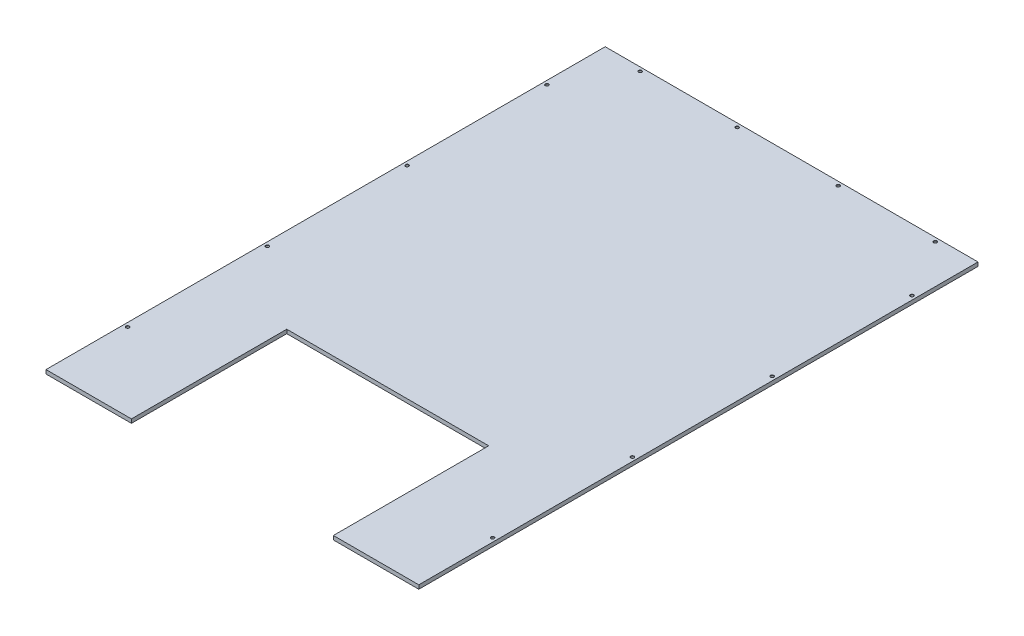
ISO-10303-21;
HEADER;
FILE_DESCRIPTION(('STEP AP214'),'2;1');
FILE_NAME('part.step','',(''),(''),'','','');
FILE_SCHEMA(('AUTOMOTIVE_DESIGN { 1 0 10303 214 1 1 1 1 }'));
ENDSEC;
DATA;
#1=APPLICATION_CONTEXT('core data for automotive mechanical design processes');
#2=APPLICATION_PROTOCOL_DEFINITION('international standard','automotive_design',2000,#1);
#3=PRODUCT_CONTEXT('',#1,'mechanical');
#4=PRODUCT('Part','Part','',(#3));
#5=PRODUCT_RELATED_PRODUCT_CATEGORY('part','',(#4));
#6=PRODUCT_DEFINITION_FORMATION('','',#4);
#7=PRODUCT_DEFINITION_CONTEXT('part definition',#1,'design');
#8=PRODUCT_DEFINITION('design','',#6,#7);
#9=PRODUCT_DEFINITION_SHAPE('','',#8);
#10=(LENGTH_UNIT() NAMED_UNIT(*) SI_UNIT(.MILLI.,.METRE.));
#11=(NAMED_UNIT(*) PLANE_ANGLE_UNIT() SI_UNIT($,.RADIAN.));
#12=(NAMED_UNIT(*) SI_UNIT($,.STERADIAN.) SOLID_ANGLE_UNIT());
#13=UNCERTAINTY_MEASURE_WITH_UNIT(LENGTH_MEASURE(1.E-05),#10,'distance_accuracy_value','');
#14=(GEOMETRIC_REPRESENTATION_CONTEXT(3) GLOBAL_UNCERTAINTY_ASSIGNED_CONTEXT((#13)) GLOBAL_UNIT_ASSIGNED_CONTEXT((#10,
#11,#12)) REPRESENTATION_CONTEXT('',''));
#15=CARTESIAN_POINT('',(0.,0.,0.));
#16=DIRECTION('',(0.,0.,1.));
#17=DIRECTION('',(1.,0.,0.));
#18=AXIS2_PLACEMENT_3D('',#15,#16,#17);
#19=CARTESIAN_POINT('',(0.,12.7,1828.8));
#20=DIRECTION('',(0.,-1.,0.));
#21=DIRECTION('',(0.,0.,-1.));
#22=AXIS2_PLACEMENT_3D('',#19,#20,#21);
#23=PLANE('',#22);
#24=CARTESIAN_POINT('',(1206.5,12.7,1574.8));
#25=DIRECTION('',(0.,1.,0.));
#26=DIRECTION('',(0.,0.,1.));
#27=AXIS2_PLACEMENT_3D('',#24,#25,#26);
#28=CIRCLE('',#27,5.39749999999994);
#29=CARTESIAN_POINT('',(1206.5,12.7,1580.1975));
#30=VERTEX_POINT('',#29);
#31=EDGE_CURVE('E502',#30,#30,#28,.T.);
#32=ORIENTED_EDGE('',*,*,#31,.F.);
#33=EDGE_LOOP('',(#32));
#34=FACE_BOUND('',#33,.T.);
#35=CARTESIAN_POINT('',(1206.5,12.7,1117.6));
#36=DIRECTION('',(0.,1.,0.));
#37=DIRECTION('',(0.,0.,1.));
#38=AXIS2_PLACEMENT_3D('',#35,#36,#37);
#39=CIRCLE('',#38,5.39749999999994);
#40=CARTESIAN_POINT('',(1206.5,12.7,1122.9975));
#41=VERTEX_POINT('',#40);
#42=EDGE_CURVE('E509',#41,#41,#39,.T.);
#43=ORIENTED_EDGE('',*,*,#42,.F.);
#44=EDGE_LOOP('',(#43));
#45=FACE_BOUND('',#44,.T.);
#46=CARTESIAN_POINT('',(1206.5,12.7,660.4));
#47=DIRECTION('',(0.,1.,0.));
#48=DIRECTION('',(0.,0.,1.));
#49=AXIS2_PLACEMENT_3D('',#46,#47,#48);
#50=CIRCLE('',#49,5.39749999999994);
#51=CARTESIAN_POINT('',(1206.5,12.7,665.7975));
#52=VERTEX_POINT('',#51);
#53=EDGE_CURVE('E518',#52,#52,#50,.T.);
#54=ORIENTED_EDGE('',*,*,#53,.F.);
#55=EDGE_LOOP('',(#54));
#56=FACE_BOUND('',#55,.T.);
#57=CARTESIAN_POINT('',(1206.5,12.7,203.2));
#58=DIRECTION('',(0.,1.,0.));
#59=DIRECTION('',(0.,0.,1.));
#60=AXIS2_PLACEMENT_3D('',#57,#58,#59);
#61=CIRCLE('',#60,5.39749999999994);
#62=CARTESIAN_POINT('',(1206.5,12.7,208.5975));
#63=VERTEX_POINT('',#62);
#64=EDGE_CURVE('E527',#63,#63,#61,.T.);
#65=ORIENTED_EDGE('',*,*,#64,.F.);
#66=EDGE_LOOP('',(#65));
#67=FACE_BOUND('',#66,.T.);
#68=CARTESIAN_POINT('',(12.7000000000004,12.7,1574.8));
#69=DIRECTION('',(0.,1.,0.));
#70=DIRECTION('',(0.,0.,1.));
#71=AXIS2_PLACEMENT_3D('',#68,#69,#70);
#72=CIRCLE('',#71,5.3975);
#73=CARTESIAN_POINT('',(12.7000000000004,12.7,1580.1975));
#74=VERTEX_POINT('',#73);
#75=EDGE_CURVE('E536',#74,#74,#72,.T.);
#76=ORIENTED_EDGE('',*,*,#75,.F.);
#77=EDGE_LOOP('',(#76));
#78=FACE_BOUND('',#77,.T.);
#79=CARTESIAN_POINT('',(12.7000000000002,12.7,1117.6));
#80=DIRECTION('',(0.,1.,0.));
#81=DIRECTION('',(0.,0.,1.));
#82=AXIS2_PLACEMENT_3D('',#79,#80,#81);
#83=CIRCLE('',#82,5.3975);
#84=CARTESIAN_POINT('',(12.7000000000002,12.7,1122.9975));
#85=VERTEX_POINT('',#84);
#86=EDGE_CURVE('E545',#85,#85,#83,.T.);
#87=ORIENTED_EDGE('',*,*,#86,.F.);
#88=EDGE_LOOP('',(#87));
#89=FACE_BOUND('',#88,.T.);
#90=CARTESIAN_POINT('',(12.7000000000002,12.7,660.4));
#91=DIRECTION('',(0.,1.,0.));
#92=DIRECTION('',(0.,0.,1.));
#93=AXIS2_PLACEMENT_3D('',#90,#91,#92);
#94=CIRCLE('',#93,5.3975);
#95=CARTESIAN_POINT('',(12.7000000000002,12.7,665.7975));
#96=VERTEX_POINT('',#95);
#97=EDGE_CURVE('E554',#96,#96,#94,.T.);
#98=ORIENTED_EDGE('',*,*,#97,.F.);
#99=EDGE_LOOP('',(#98));
#100=FACE_BOUND('',#99,.T.);
#101=CARTESIAN_POINT('',(12.6999999999999,12.7,203.2));
#102=DIRECTION('',(0.,1.,0.));
#103=DIRECTION('',(0.,0.,1.));
#104=AXIS2_PLACEMENT_3D('',#101,#102,#103);
#105=CIRCLE('',#104,5.3975);
#106=CARTESIAN_POINT('',(12.6999999999999,12.7,208.5975));
#107=VERTEX_POINT('',#106);
#108=EDGE_CURVE('E563',#107,#107,#105,.T.);
#109=ORIENTED_EDGE('',*,*,#108,.F.);
#110=EDGE_LOOP('',(#109));
#111=FACE_BOUND('',#110,.T.);
#112=CARTESIAN_POINT('',(444.5,12.7,12.7000000000002));
#113=DIRECTION('',(0.,1.,0.));
#114=DIRECTION('',(0.,0.,1.));
#115=AXIS2_PLACEMENT_3D('',#112,#113,#114);
#116=CIRCLE('',#115,5.3975);
#117=CARTESIAN_POINT('',(444.5,12.7,18.0975000000002));
#118=VERTEX_POINT('',#117);
#119=EDGE_CURVE('E572',#118,#118,#116,.T.);
#120=ORIENTED_EDGE('',*,*,#119,.F.);
#121=EDGE_LOOP('',(#120));
#122=FACE_BOUND('',#121,.T.);
#123=CARTESIAN_POINT('',(1092.2,12.7,12.7000000000001));
#124=DIRECTION('',(0.,1.,0.));
#125=DIRECTION('',(0.,0.,1.));
#126=AXIS2_PLACEMENT_3D('',#123,#124,#125);
#127=CIRCLE('',#126,5.39749999999994);
#128=CARTESIAN_POINT('',(1092.2,12.7,18.0975));
#129=VERTEX_POINT('',#128);
#130=EDGE_CURVE('E590',#129,#129,#127,.T.);
#131=ORIENTED_EDGE('',*,*,#130,.F.);
#132=EDGE_LOOP('',(#131));
#133=FACE_BOUND('',#132,.T.);
#134=CARTESIAN_POINT('',(774.7,12.7,12.7000000000002));
#135=DIRECTION('',(0.,1.,0.));
#136=DIRECTION('',(0.,0.,1.));
#137=AXIS2_PLACEMENT_3D('',#134,#135,#136);
#138=CIRCLE('',#137,5.39750000000006);
#139=CARTESIAN_POINT('',(774.7,12.7,18.0975000000002));
#140=VERTEX_POINT('',#139);
#141=EDGE_CURVE('E599',#140,#140,#138,.T.);
#142=ORIENTED_EDGE('',*,*,#141,.F.);
#143=EDGE_LOOP('',(#142));
#144=FACE_BOUND('',#143,.T.);
#145=DIRECTION('',(0.,0.,-1.));
#146=VECTOR('',#145,1.);
#147=CARTESIAN_POINT('',(279.4,12.7,1828.8));
#148=LINE('',#147,#146);
#149=CARTESIAN_POINT('',(279.4,12.7,1828.8));
#150=VERTEX_POINT('',#149);
#151=CARTESIAN_POINT('',(279.4,12.7,1320.8));
#152=VERTEX_POINT('',#151);
#153=EDGE_CURVE('E138',#150,#152,#148,.T.);
#154=ORIENTED_EDGE('',*,*,#153,.T.);
#155=DIRECTION('',(1.,0.,0.));
#156=VECTOR('',#155,1.);
#157=CARTESIAN_POINT('',(279.4,12.7,1320.8));
#158=LINE('',#157,#156);
#159=CARTESIAN_POINT('',(939.8,12.7,1320.8));
#160=VERTEX_POINT('',#159);
#161=EDGE_CURVE('E128',#152,#160,#158,.T.);
#162=ORIENTED_EDGE('',*,*,#161,.T.);
#163=DIRECTION('',(0.,0.,1.));
#164=VECTOR('',#163,1.);
#165=CARTESIAN_POINT('',(939.8,12.7,1320.8));
#166=LINE('',#165,#164);
#167=CARTESIAN_POINT('',(939.8,12.7,1828.8));
#168=VERTEX_POINT('',#167);
#169=EDGE_CURVE('E123',#160,#168,#166,.T.);
#170=ORIENTED_EDGE('',*,*,#169,.T.);
#171=DIRECTION('',(-1.,0.,0.));
#172=VECTOR('',#171,1.);
#173=CARTESIAN_POINT('',(0.,12.7,1828.8));
#174=LINE('',#173,#172);
#175=CARTESIAN_POINT('',(1219.2,12.7,1828.8));
#176=VERTEX_POINT('',#175);
#177=EDGE_CURVE('E154',#176,#168,#174,.T.);
#178=ORIENTED_EDGE('',*,*,#177,.F.);
#179=DIRECTION('',(0.,0.,-1.));
#180=VECTOR('',#179,1.);
#181=CARTESIAN_POINT('',(1219.2,12.7,1828.8));
#182=LINE('',#181,#180);
#183=CARTESIAN_POINT('',(1219.2,12.7,0.));
#184=VERTEX_POINT('',#183);
#185=EDGE_CURVE('E166',#176,#184,#182,.T.);
#186=ORIENTED_EDGE('',*,*,#185,.T.);
#187=DIRECTION('',(-1.,0.,0.));
#188=VECTOR('',#187,1.);
#189=CARTESIAN_POINT('',(0.,12.7,0.));
#190=LINE('',#189,#188);
#191=CARTESIAN_POINT('',(0.,12.7,0.));
#192=VERTEX_POINT('',#191);
#193=EDGE_CURVE('E85',#184,#192,#190,.T.);
#194=ORIENTED_EDGE('',*,*,#193,.T.);
#195=DIRECTION('',(0.,0.,-1.));
#196=VECTOR('',#195,1.);
#197=CARTESIAN_POINT('',(0.,12.7,1828.8));
#198=LINE('',#197,#196);
#199=CARTESIAN_POINT('',(0.,12.7,1828.8));
#200=VERTEX_POINT('',#199);
#201=EDGE_CURVE('E157',#200,#192,#198,.T.);
#202=ORIENTED_EDGE('',*,*,#201,.F.);
#203=EDGE_CURVE('E63',#150,#200,#174,.T.);
#204=ORIENTED_EDGE('',*,*,#203,.F.);
#205=EDGE_LOOP('',(#154,#162,#170,#178,#186,#194,#202,#204));
#206=FACE_BOUND('',#205,.T.);
#207=CARTESIAN_POINT('',(127.,12.7,12.7000000000002));
#208=DIRECTION('',(0.,1.,0.));
#209=DIRECTION('',(0.,0.,1.));
#210=AXIS2_PLACEMENT_3D('',#207,#208,#209);
#211=CIRCLE('',#210,5.3975);
#212=CARTESIAN_POINT('',(127.,12.7,18.0975000000002));
#213=VERTEX_POINT('',#212);
#214=EDGE_CURVE('E581',#213,#213,#211,.T.);
#215=ORIENTED_EDGE('',*,*,#214,.F.);
#216=EDGE_LOOP('',(#215));
#217=FACE_BOUND('',#216,.T.);
#218=ADVANCED_FACE('F39',(#34,#45,#56,#67,#78,#89,#100,#111,#122,#133,#144,#206,#217),#23,.F.);
#219=CARTESIAN_POINT('',(0.,0.,1828.8));
#220=DIRECTION('',(0.,1.,0.));
#221=DIRECTION('',(0.,0.,1.));
#222=AXIS2_PLACEMENT_3D('',#219,#220,#221);
#223=PLANE('',#222);
#224=CARTESIAN_POINT('',(1206.5,0.,1574.8));
#225=DIRECTION('',(0.,1.,0.));
#226=DIRECTION('',(0.,0.,1.));
#227=AXIS2_PLACEMENT_3D('',#224,#225,#226);
#228=CIRCLE('',#227,4.7625);
#229=CARTESIAN_POINT('',(1206.5,0.,1579.5625));
#230=VERTEX_POINT('',#229);
#231=EDGE_CURVE('E504',#230,#230,#228,.T.);
#232=ORIENTED_EDGE('',*,*,#231,.T.);
#233=EDGE_LOOP('',(#232));
#234=FACE_BOUND('',#233,.T.);
#235=CARTESIAN_POINT('',(1206.5,0.,1117.6));
#236=DIRECTION('',(0.,1.,0.));
#237=DIRECTION('',(0.,0.,1.));
#238=AXIS2_PLACEMENT_3D('',#235,#236,#237);
#239=CIRCLE('',#238,4.7625);
#240=CARTESIAN_POINT('',(1206.5,0.,1122.3625));
#241=VERTEX_POINT('',#240);
#242=EDGE_CURVE('E515',#241,#241,#239,.T.);
#243=ORIENTED_EDGE('',*,*,#242,.T.);
#244=EDGE_LOOP('',(#243));
#245=FACE_BOUND('',#244,.T.);
#246=CARTESIAN_POINT('',(1206.5,0.,660.4));
#247=DIRECTION('',(0.,1.,0.));
#248=DIRECTION('',(0.,0.,1.));
#249=AXIS2_PLACEMENT_3D('',#246,#247,#248);
#250=CIRCLE('',#249,4.7625);
#251=CARTESIAN_POINT('',(1206.5,0.,665.1625));
#252=VERTEX_POINT('',#251);
#253=EDGE_CURVE('E524',#252,#252,#250,.T.);
#254=ORIENTED_EDGE('',*,*,#253,.T.);
#255=EDGE_LOOP('',(#254));
#256=FACE_BOUND('',#255,.T.);
#257=CARTESIAN_POINT('',(1206.5,0.,203.2));
#258=DIRECTION('',(0.,1.,0.));
#259=DIRECTION('',(0.,0.,1.));
#260=AXIS2_PLACEMENT_3D('',#257,#258,#259);
#261=CIRCLE('',#260,4.7625);
#262=CARTESIAN_POINT('',(1206.5,0.,207.9625));
#263=VERTEX_POINT('',#262);
#264=EDGE_CURVE('E533',#263,#263,#261,.T.);
#265=ORIENTED_EDGE('',*,*,#264,.T.);
#266=EDGE_LOOP('',(#265));
#267=FACE_BOUND('',#266,.T.);
#268=CARTESIAN_POINT('',(12.7000000000004,0.,1574.8));
#269=DIRECTION('',(0.,1.,0.));
#270=DIRECTION('',(0.,0.,1.));
#271=AXIS2_PLACEMENT_3D('',#268,#269,#270);
#272=CIRCLE('',#271,4.7625);
#273=CARTESIAN_POINT('',(12.7000000000004,0.,1579.5625));
#274=VERTEX_POINT('',#273);
#275=EDGE_CURVE('E542',#274,#274,#272,.T.);
#276=ORIENTED_EDGE('',*,*,#275,.T.);
#277=EDGE_LOOP('',(#276));
#278=FACE_BOUND('',#277,.T.);
#279=CARTESIAN_POINT('',(12.7000000000002,0.,1117.6));
#280=DIRECTION('',(0.,1.,0.));
#281=DIRECTION('',(0.,0.,1.));
#282=AXIS2_PLACEMENT_3D('',#279,#280,#281);
#283=CIRCLE('',#282,4.7625);
#284=CARTESIAN_POINT('',(12.7000000000002,0.,1122.3625));
#285=VERTEX_POINT('',#284);
#286=EDGE_CURVE('E551',#285,#285,#283,.T.);
#287=ORIENTED_EDGE('',*,*,#286,.T.);
#288=EDGE_LOOP('',(#287));
#289=FACE_BOUND('',#288,.T.);
#290=CARTESIAN_POINT('',(12.7000000000002,0.,660.4));
#291=DIRECTION('',(0.,1.,0.));
#292=DIRECTION('',(0.,0.,1.));
#293=AXIS2_PLACEMENT_3D('',#290,#291,#292);
#294=CIRCLE('',#293,4.7625);
#295=CARTESIAN_POINT('',(12.7000000000002,0.,665.1625));
#296=VERTEX_POINT('',#295);
#297=EDGE_CURVE('E560',#296,#296,#294,.T.);
#298=ORIENTED_EDGE('',*,*,#297,.T.);
#299=EDGE_LOOP('',(#298));
#300=FACE_BOUND('',#299,.T.);
#301=CARTESIAN_POINT('',(12.6999999999999,0.,203.2));
#302=DIRECTION('',(0.,1.,0.));
#303=DIRECTION('',(0.,0.,1.));
#304=AXIS2_PLACEMENT_3D('',#301,#302,#303);
#305=CIRCLE('',#304,4.7625);
#306=CARTESIAN_POINT('',(12.6999999999999,0.,207.9625));
#307=VERTEX_POINT('',#306);
#308=EDGE_CURVE('E569',#307,#307,#305,.T.);
#309=ORIENTED_EDGE('',*,*,#308,.T.);
#310=EDGE_LOOP('',(#309));
#311=FACE_BOUND('',#310,.T.);
#312=CARTESIAN_POINT('',(444.5,0.,12.7000000000002));
#313=DIRECTION('',(0.,1.,0.));
#314=DIRECTION('',(0.,0.,1.));
#315=AXIS2_PLACEMENT_3D('',#312,#313,#314);
#316=CIRCLE('',#315,4.7625);
#317=CARTESIAN_POINT('',(444.5,0.,17.4625000000002));
#318=VERTEX_POINT('',#317);
#319=EDGE_CURVE('E578',#318,#318,#316,.T.);
#320=ORIENTED_EDGE('',*,*,#319,.T.);
#321=EDGE_LOOP('',(#320));
#322=FACE_BOUND('',#321,.T.);
#323=CARTESIAN_POINT('',(127.,0.,12.7000000000002));
#324=DIRECTION('',(0.,1.,0.));
#325=DIRECTION('',(0.,0.,1.));
#326=AXIS2_PLACEMENT_3D('',#323,#324,#325);
#327=CIRCLE('',#326,4.7625);
#328=CARTESIAN_POINT('',(127.,0.,17.4625000000002));
#329=VERTEX_POINT('',#328);
#330=EDGE_CURVE('E587',#329,#329,#327,.T.);
#331=ORIENTED_EDGE('',*,*,#330,.T.);
#332=EDGE_LOOP('',(#331));
#333=FACE_BOUND('',#332,.T.);
#334=CARTESIAN_POINT('',(1092.2,0.,12.7000000000001));
#335=DIRECTION('',(0.,1.,0.));
#336=DIRECTION('',(0.,0.,1.));
#337=AXIS2_PLACEMENT_3D('',#334,#335,#336);
#338=CIRCLE('',#337,4.7625);
#339=CARTESIAN_POINT('',(1092.2,0.,17.4625000000001));
#340=VERTEX_POINT('',#339);
#341=EDGE_CURVE('E596',#340,#340,#338,.T.);
#342=ORIENTED_EDGE('',*,*,#341,.T.);
#343=EDGE_LOOP('',(#342));
#344=FACE_BOUND('',#343,.T.);
#345=CARTESIAN_POINT('',(774.7,0.,12.7000000000002));
#346=DIRECTION('',(0.,1.,0.));
#347=DIRECTION('',(0.,0.,1.));
#348=AXIS2_PLACEMENT_3D('',#345,#346,#347);
#349=CIRCLE('',#348,4.7625);
#350=CARTESIAN_POINT('',(774.7,0.,17.4625000000002));
#351=VERTEX_POINT('',#350);
#352=EDGE_CURVE('E140',#351,#351,#349,.T.);
#353=ORIENTED_EDGE('',*,*,#352,.T.);
#354=EDGE_LOOP('',(#353));
#355=FACE_BOUND('',#354,.T.);
#356=DIRECTION('',(0.,0.,-1.));
#357=VECTOR('',#356,1.);
#358=CARTESIAN_POINT('',(279.4,0.,1828.8));
#359=LINE('',#358,#357);
#360=CARTESIAN_POINT('',(279.4,0.,1828.8));
#361=VERTEX_POINT('',#360);
#362=CARTESIAN_POINT('',(279.4,0.,1320.8));
#363=VERTEX_POINT('',#362);
#364=EDGE_CURVE('E115',#361,#363,#359,.T.);
#365=ORIENTED_EDGE('',*,*,#364,.F.);
#366=DIRECTION('',(1.,0.,0.));
#367=VECTOR('',#366,1.);
#368=CARTESIAN_POINT('',(0.,0.,1828.8));
#369=LINE('',#368,#367);
#370=CARTESIAN_POINT('',(0.,0.,1828.8));
#371=VERTEX_POINT('',#370);
#372=EDGE_CURVE('E92',#371,#361,#369,.T.);
#373=ORIENTED_EDGE('',*,*,#372,.F.);
#374=DIRECTION('',(0.,0.,-1.));
#375=VECTOR('',#374,1.);
#376=CARTESIAN_POINT('',(0.,0.,1828.8));
#377=LINE('',#376,#375);
#378=CARTESIAN_POINT('',(0.,0.,0.));
#379=VERTEX_POINT('',#378);
#380=EDGE_CURVE('E11',#371,#379,#377,.T.);
#381=ORIENTED_EDGE('',*,*,#380,.T.);
#382=DIRECTION('',(1.,0.,0.));
#383=VECTOR('',#382,1.);
#384=CARTESIAN_POINT('',(0.,0.,0.));
#385=LINE('',#384,#383);
#386=CARTESIAN_POINT('',(1219.2,0.,0.));
#387=VERTEX_POINT('',#386);
#388=EDGE_CURVE('E160',#379,#387,#385,.T.);
#389=ORIENTED_EDGE('',*,*,#388,.T.);
#390=DIRECTION('',(0.,0.,-1.));
#391=VECTOR('',#390,1.);
#392=CARTESIAN_POINT('',(1219.2,0.,1828.8));
#393=LINE('',#392,#391);
#394=CARTESIAN_POINT('',(1219.2,0.,1828.8));
#395=VERTEX_POINT('',#394);
#396=EDGE_CURVE('E47',#395,#387,#393,.T.);
#397=ORIENTED_EDGE('',*,*,#396,.F.);
#398=CARTESIAN_POINT('',(939.8,0.,1828.8));
#399=VERTEX_POINT('',#398);
#400=EDGE_CURVE('E150',#399,#395,#369,.T.);
#401=ORIENTED_EDGE('',*,*,#400,.F.);
#402=DIRECTION('',(0.,0.,1.));
#403=VECTOR('',#402,1.);
#404=CARTESIAN_POINT('',(939.8,0.,1320.8));
#405=LINE('',#404,#403);
#406=CARTESIAN_POINT('',(939.8,0.,1320.8));
#407=VERTEX_POINT('',#406);
#408=EDGE_CURVE('E54',#407,#399,#405,.T.);
#409=ORIENTED_EDGE('',*,*,#408,.F.);
#410=DIRECTION('',(1.,0.,0.));
#411=VECTOR('',#410,1.);
#412=CARTESIAN_POINT('',(279.4,0.,1320.8));
#413=LINE('',#412,#411);
#414=EDGE_CURVE('E122',#363,#407,#413,.T.);
#415=ORIENTED_EDGE('',*,*,#414,.F.);
#416=EDGE_LOOP('',(#365,#373,#381,#389,#397,#401,#409,#415));
#417=FACE_BOUND('',#416,.T.);
#418=ADVANCED_FACE('F132',(#234,#245,#256,#267,#278,#289,#300,#311,#322,#333,#344,#355,#417),
#223,.F.);
#419=CARTESIAN_POINT('',(0.,0.,1828.8));
#420=DIRECTION('',(0.,0.,-1.));
#421=DIRECTION('',(-1.,0.,0.));
#422=AXIS2_PLACEMENT_3D('',#419,#420,#421);
#423=PLANE('',#422);
#424=DIRECTION('',(0.,1.,0.));
#425=VECTOR('',#424,1.);
#426=CARTESIAN_POINT('',(279.4,0.,1828.8));
#427=LINE('',#426,#425);
#428=EDGE_CURVE('E120',#361,#150,#427,.T.);
#429=ORIENTED_EDGE('',*,*,#428,.T.);
#430=ORIENTED_EDGE('',*,*,#203,.T.);
#431=DIRECTION('',(0.,-1.,0.));
#432=VECTOR('',#431,1.);
#433=CARTESIAN_POINT('',(0.,0.,1828.8));
#434=LINE('',#433,#432);
#435=EDGE_CURVE('E148',#200,#371,#434,.T.);
#436=ORIENTED_EDGE('',*,*,#435,.T.);
#437=ORIENTED_EDGE('',*,*,#372,.T.);
#438=EDGE_LOOP('',(#429,#430,#436,#437));
#439=FACE_BOUND('',#438,.T.);
#440=ADVANCED_FACE('F181',(#439),#423,.F.);
#441=DIRECTION('',(0.,1.,0.));
#442=VECTOR('',#441,1.);
#443=CARTESIAN_POINT('',(939.8,0.,1828.8));
#444=LINE('',#443,#442);
#445=EDGE_CURVE('E145',#399,#168,#444,.T.);
#446=ORIENTED_EDGE('',*,*,#445,.F.);
#447=ORIENTED_EDGE('',*,*,#400,.T.);
#448=DIRECTION('',(0.,1.,0.));
#449=VECTOR('',#448,1.);
#450=CARTESIAN_POINT('',(1219.2,0.,1828.8));
#451=LINE('',#450,#449);
#452=EDGE_CURVE('E152',#395,#176,#451,.T.);
#453=ORIENTED_EDGE('',*,*,#452,.T.);
#454=ORIENTED_EDGE('',*,*,#177,.T.);
#455=EDGE_LOOP('',(#446,#447,#453,#454));
#456=FACE_BOUND('',#455,.T.);
#457=ADVANCED_FACE('F183',(#456),#423,.F.);
#458=CARTESIAN_POINT('',(0.,0.,1828.8));
#459=DIRECTION('',(1.,0.,0.));
#460=DIRECTION('',(0.,0.,-1.));
#461=AXIS2_PLACEMENT_3D('',#458,#459,#460);
#462=PLANE('',#461);
#463=DIRECTION('',(0.,-1.,0.));
#464=VECTOR('',#463,1.);
#465=CARTESIAN_POINT('',(0.,0.,0.));
#466=LINE('',#465,#464);
#467=EDGE_CURVE('E129',#192,#379,#466,.T.);
#468=ORIENTED_EDGE('',*,*,#467,.T.);
#469=ORIENTED_EDGE('',*,*,#380,.F.);
#470=ORIENTED_EDGE('',*,*,#435,.F.);
#471=ORIENTED_EDGE('',*,*,#201,.T.);
#472=EDGE_LOOP('',(#468,#469,#470,#471));
#473=FACE_BOUND('',#472,.T.);
#474=ADVANCED_FACE('F41',(#473),#462,.F.);
#475=CARTESIAN_POINT('',(1219.2,0.,1828.8));
#476=DIRECTION('',(-1.,0.,0.));
#477=DIRECTION('',(0.,0.,1.));
#478=AXIS2_PLACEMENT_3D('',#475,#476,#477);
#479=PLANE('',#478);
#480=DIRECTION('',(0.,1.,0.));
#481=VECTOR('',#480,1.);
#482=CARTESIAN_POINT('',(1219.2,0.,0.));
#483=LINE('',#482,#481);
#484=EDGE_CURVE('E162',#387,#184,#483,.T.);
#485=ORIENTED_EDGE('',*,*,#484,.T.);
#486=ORIENTED_EDGE('',*,*,#185,.F.);
#487=ORIENTED_EDGE('',*,*,#452,.F.);
#488=ORIENTED_EDGE('',*,*,#396,.T.);
#489=EDGE_LOOP('',(#485,#486,#487,#488));
#490=FACE_BOUND('',#489,.T.);
#491=ADVANCED_FACE('F172',(#490),#479,.F.);
#492=CARTESIAN_POINT('',(0.,0.,0.));
#493=DIRECTION('',(0.,0.,-1.));
#494=DIRECTION('',(-1.,0.,0.));
#495=AXIS2_PLACEMENT_3D('',#492,#493,#494);
#496=PLANE('',#495);
#497=ORIENTED_EDGE('',*,*,#467,.F.);
#498=ORIENTED_EDGE('',*,*,#193,.F.);
#499=ORIENTED_EDGE('',*,*,#484,.F.);
#500=ORIENTED_EDGE('',*,*,#388,.F.);
#501=EDGE_LOOP('',(#497,#498,#499,#500));
#502=FACE_BOUND('',#501,.T.);
#503=ADVANCED_FACE('F176',(#502),#496,.T.);
#504=CARTESIAN_POINT('',(279.4,0.,1828.8));
#505=DIRECTION('',(1.,0.,0.));
#506=DIRECTION('',(0.,0.,-1.));
#507=AXIS2_PLACEMENT_3D('',#504,#505,#506);
#508=PLANE('',#507);
#509=ORIENTED_EDGE('',*,*,#153,.F.);
#510=ORIENTED_EDGE('',*,*,#428,.F.);
#511=ORIENTED_EDGE('',*,*,#364,.T.);
#512=DIRECTION('',(0.,1.,0.));
#513=VECTOR('',#512,1.);
#514=CARTESIAN_POINT('',(279.4,0.,1320.8));
#515=LINE('',#514,#513);
#516=EDGE_CURVE('E118',#363,#152,#515,.T.);
#517=ORIENTED_EDGE('',*,*,#516,.T.);
#518=EDGE_LOOP('',(#509,#510,#511,#517));
#519=FACE_BOUND('',#518,.T.);
#520=ADVANCED_FACE('F117',(#519),#508,.T.);
#521=CARTESIAN_POINT('',(279.4,0.,1320.8));
#522=DIRECTION('',(0.,0.,1.));
#523=DIRECTION('',(1.,0.,0.));
#524=AXIS2_PLACEMENT_3D('',#521,#522,#523);
#525=PLANE('',#524);
#526=ORIENTED_EDGE('',*,*,#161,.F.);
#527=ORIENTED_EDGE('',*,*,#516,.F.);
#528=ORIENTED_EDGE('',*,*,#414,.T.);
#529=DIRECTION('',(0.,1.,0.));
#530=VECTOR('',#529,1.);
#531=CARTESIAN_POINT('',(939.8,0.,1320.8));
#532=LINE('',#531,#530);
#533=EDGE_CURVE('E130',#407,#160,#532,.T.);
#534=ORIENTED_EDGE('',*,*,#533,.T.);
#535=EDGE_LOOP('',(#526,#527,#528,#534));
#536=FACE_BOUND('',#535,.T.);
#537=ADVANCED_FACE('F126',(#536),#525,.T.);
#538=CARTESIAN_POINT('',(939.8,0.,1320.8));
#539=DIRECTION('',(-1.,0.,0.));
#540=DIRECTION('',(0.,0.,1.));
#541=AXIS2_PLACEMENT_3D('',#538,#539,#540);
#542=PLANE('',#541);
#543=ORIENTED_EDGE('',*,*,#169,.F.);
#544=ORIENTED_EDGE('',*,*,#533,.F.);
#545=ORIENTED_EDGE('',*,*,#408,.T.);
#546=ORIENTED_EDGE('',*,*,#445,.T.);
#547=EDGE_LOOP('',(#543,#544,#545,#546));
#548=FACE_BOUND('',#547,.T.);
#549=ADVANCED_FACE('F233',(#548),#542,.T.);
#550=CARTESIAN_POINT('',(774.7,12.7,12.7000000000002));
#551=DIRECTION('',(0.,1.,0.));
#552=DIRECTION('',(0.,0.,1.));
#553=AXIS2_PLACEMENT_3D('',#550,#551,#552);
#554=CYLINDRICAL_SURFACE('',#553,4.7625);
#555=ORIENTED_EDGE('',*,*,#352,.F.);
#556=EDGE_LOOP('',(#555));
#557=FACE_BOUND('',#556,.T.);
#558=CARTESIAN_POINT('',(774.7,12.065,12.7000000000002));
#559=DIRECTION('',(0.,1.,0.));
#560=DIRECTION('',(0.,0.,1.));
#561=AXIS2_PLACEMENT_3D('',#558,#559,#560);
#562=CIRCLE('',#561,4.7625);
#563=CARTESIAN_POINT('',(774.7,12.065,17.4625000000002));
#564=VERTEX_POINT('',#563);
#565=EDGE_CURVE('E602',#564,#564,#562,.T.);
#566=ORIENTED_EDGE('',*,*,#565,.T.);
#567=EDGE_LOOP('',(#566));
#568=FACE_BOUND('',#567,.T.);
#569=ADVANCED_FACE('F242',(#557,#568),#554,.F.);
#570=CARTESIAN_POINT('',(774.7,12.7,12.7000000000002));
#571=DIRECTION('',(0.,1.,0.));
#572=DIRECTION('',(0.,0.,1.));
#573=AXIS2_PLACEMENT_3D('',#570,#571,#572);
#574=CONICAL_SURFACE('',#573,5.39750000000006,0.785398163397488);
#575=ORIENTED_EDGE('',*,*,#565,.F.);
#576=EDGE_LOOP('',(#575));
#577=FACE_BOUND('',#576,.T.);
#578=ORIENTED_EDGE('',*,*,#141,.T.);
#579=EDGE_LOOP('',(#578));
#580=FACE_BOUND('',#579,.T.);
#581=ADVANCED_FACE('F263',(#577,#580),#574,.F.);
#582=CARTESIAN_POINT('',(1092.2,12.7,12.7000000000001));
#583=DIRECTION('',(0.,1.,0.));
#584=DIRECTION('',(0.,0.,1.));
#585=AXIS2_PLACEMENT_3D('',#582,#583,#584);
#586=CYLINDRICAL_SURFACE('',#585,4.7625);
#587=ORIENTED_EDGE('',*,*,#341,.F.);
#588=EDGE_LOOP('',(#587));
#589=FACE_BOUND('',#588,.T.);
#590=CARTESIAN_POINT('',(1092.2,12.065,12.7000000000001));
#591=DIRECTION('',(0.,1.,0.));
#592=DIRECTION('',(0.,0.,1.));
#593=AXIS2_PLACEMENT_3D('',#590,#591,#592);
#594=CIRCLE('',#593,4.7625);
#595=CARTESIAN_POINT('',(1092.2,12.065,17.4625000000001));
#596=VERTEX_POINT('',#595);
#597=EDGE_CURVE('E593',#596,#596,#594,.T.);
#598=ORIENTED_EDGE('',*,*,#597,.T.);
#599=EDGE_LOOP('',(#598));
#600=FACE_BOUND('',#599,.T.);
#601=ADVANCED_FACE('F273',(#589,#600),#586,.F.);
#602=CARTESIAN_POINT('',(1092.2,12.7,12.7000000000001));
#603=DIRECTION('',(0.,1.,0.));
#604=DIRECTION('',(0.,0.,1.));
#605=AXIS2_PLACEMENT_3D('',#602,#603,#604);
#606=CONICAL_SURFACE('',#605,5.39749999999994,0.785398163397401);
#607=ORIENTED_EDGE('',*,*,#597,.F.);
#608=EDGE_LOOP('',(#607));
#609=FACE_BOUND('',#608,.T.);
#610=ORIENTED_EDGE('',*,*,#130,.T.);
#611=EDGE_LOOP('',(#610));
#612=FACE_BOUND('',#611,.T.);
#613=ADVANCED_FACE('F283',(#609,#612),#606,.F.);
#614=CARTESIAN_POINT('',(127.,12.7,12.7000000000002));
#615=DIRECTION('',(0.,1.,0.));
#616=DIRECTION('',(0.,0.,1.));
#617=AXIS2_PLACEMENT_3D('',#614,#615,#616);
#618=CYLINDRICAL_SURFACE('',#617,4.7625);
#619=ORIENTED_EDGE('',*,*,#330,.F.);
#620=EDGE_LOOP('',(#619));
#621=FACE_BOUND('',#620,.T.);
#622=CARTESIAN_POINT('',(127.,12.065,12.7000000000002));
#623=DIRECTION('',(0.,1.,0.));
#624=DIRECTION('',(0.,0.,1.));
#625=AXIS2_PLACEMENT_3D('',#622,#623,#624);
#626=CIRCLE('',#625,4.7625);
#627=CARTESIAN_POINT('',(127.,12.065,17.4625000000002));
#628=VERTEX_POINT('',#627);
#629=EDGE_CURVE('E584',#628,#628,#626,.T.);
#630=ORIENTED_EDGE('',*,*,#629,.T.);
#631=EDGE_LOOP('',(#630));
#632=FACE_BOUND('',#631,.T.);
#633=ADVANCED_FACE('F293',(#621,#632),#618,.F.);
#634=CARTESIAN_POINT('',(127.,12.7,12.7000000000002));
#635=DIRECTION('',(0.,1.,0.));
#636=DIRECTION('',(0.,0.,1.));
#637=AXIS2_PLACEMENT_3D('',#634,#635,#636);
#638=CONICAL_SURFACE('',#637,5.3975,0.785398163397444);
#639=ORIENTED_EDGE('',*,*,#629,.F.);
#640=EDGE_LOOP('',(#639));
#641=FACE_BOUND('',#640,.T.);
#642=ORIENTED_EDGE('',*,*,#214,.T.);
#643=EDGE_LOOP('',(#642));
#644=FACE_BOUND('',#643,.T.);
#645=ADVANCED_FACE('F303',(#641,#644),#638,.F.);
#646=CARTESIAN_POINT('',(444.5,12.7,12.7000000000002));
#647=DIRECTION('',(0.,1.,0.));
#648=DIRECTION('',(0.,0.,1.));
#649=AXIS2_PLACEMENT_3D('',#646,#647,#648);
#650=CYLINDRICAL_SURFACE('',#649,4.7625);
#651=ORIENTED_EDGE('',*,*,#319,.F.);
#652=EDGE_LOOP('',(#651));
#653=FACE_BOUND('',#652,.T.);
#654=CARTESIAN_POINT('',(444.5,12.065,12.7000000000002));
#655=DIRECTION('',(0.,1.,0.));
#656=DIRECTION('',(0.,0.,1.));
#657=AXIS2_PLACEMENT_3D('',#654,#655,#656);
#658=CIRCLE('',#657,4.7625);
#659=CARTESIAN_POINT('',(444.5,12.065,17.4625000000002));
#660=VERTEX_POINT('',#659);
#661=EDGE_CURVE('E575',#660,#660,#658,.T.);
#662=ORIENTED_EDGE('',*,*,#661,.T.);
#663=EDGE_LOOP('',(#662));
#664=FACE_BOUND('',#663,.T.);
#665=ADVANCED_FACE('F313',(#653,#664),#650,.F.);
#666=CARTESIAN_POINT('',(444.5,12.7,12.7000000000002));
#667=DIRECTION('',(0.,1.,0.));
#668=DIRECTION('',(0.,0.,1.));
#669=AXIS2_PLACEMENT_3D('',#666,#667,#668);
#670=CONICAL_SURFACE('',#669,5.3975,0.785398163397444);
#671=ORIENTED_EDGE('',*,*,#661,.F.);
#672=EDGE_LOOP('',(#671));
#673=FACE_BOUND('',#672,.T.);
#674=ORIENTED_EDGE('',*,*,#119,.T.);
#675=EDGE_LOOP('',(#674));
#676=FACE_BOUND('',#675,.T.);
#677=ADVANCED_FACE('F323',(#673,#676),#670,.F.);
#678=CARTESIAN_POINT('',(12.6999999999999,12.7,203.2));
#679=DIRECTION('',(0.,1.,0.));
#680=DIRECTION('',(0.,0.,1.));
#681=AXIS2_PLACEMENT_3D('',#678,#679,#680);
#682=CYLINDRICAL_SURFACE('',#681,4.7625);
#683=ORIENTED_EDGE('',*,*,#308,.F.);
#684=EDGE_LOOP('',(#683));
#685=FACE_BOUND('',#684,.T.);
#686=CARTESIAN_POINT('',(12.6999999999999,12.065,203.2));
#687=DIRECTION('',(0.,1.,0.));
#688=DIRECTION('',(0.,0.,1.));
#689=AXIS2_PLACEMENT_3D('',#686,#687,#688);
#690=CIRCLE('',#689,4.7625);
#691=CARTESIAN_POINT('',(12.6999999999999,12.065,207.9625));
#692=VERTEX_POINT('',#691);
#693=EDGE_CURVE('E566',#692,#692,#690,.T.);
#694=ORIENTED_EDGE('',*,*,#693,.T.);
#695=EDGE_LOOP('',(#694));
#696=FACE_BOUND('',#695,.T.);
#697=ADVANCED_FACE('F333',(#685,#696),#682,.F.);
#698=CARTESIAN_POINT('',(12.6999999999999,12.7,203.2));
#699=DIRECTION('',(0.,1.,0.));
#700=DIRECTION('',(0.,0.,1.));
#701=AXIS2_PLACEMENT_3D('',#698,#699,#700);
#702=CONICAL_SURFACE('',#701,5.3975,0.785398163397447);
#703=ORIENTED_EDGE('',*,*,#693,.F.);
#704=EDGE_LOOP('',(#703));
#705=FACE_BOUND('',#704,.T.);
#706=ORIENTED_EDGE('',*,*,#108,.T.);
#707=EDGE_LOOP('',(#706));
#708=FACE_BOUND('',#707,.T.);
#709=ADVANCED_FACE('F343',(#705,#708),#702,.F.);
#710=CARTESIAN_POINT('',(12.7000000000002,12.7,660.4));
#711=DIRECTION('',(0.,1.,0.));
#712=DIRECTION('',(0.,0.,1.));
#713=AXIS2_PLACEMENT_3D('',#710,#711,#712);
#714=CYLINDRICAL_SURFACE('',#713,4.7625);
#715=ORIENTED_EDGE('',*,*,#297,.F.);
#716=EDGE_LOOP('',(#715));
#717=FACE_BOUND('',#716,.T.);
#718=CARTESIAN_POINT('',(12.7000000000002,12.065,660.4));
#719=DIRECTION('',(0.,1.,0.));
#720=DIRECTION('',(0.,0.,1.));
#721=AXIS2_PLACEMENT_3D('',#718,#719,#720);
#722=CIRCLE('',#721,4.7625);
#723=CARTESIAN_POINT('',(12.7000000000002,12.065,665.1625));
#724=VERTEX_POINT('',#723);
#725=EDGE_CURVE('E557',#724,#724,#722,.T.);
#726=ORIENTED_EDGE('',*,*,#725,.T.);
#727=EDGE_LOOP('',(#726));
#728=FACE_BOUND('',#727,.T.);
#729=ADVANCED_FACE('F353',(#717,#728),#714,.F.);
#730=CARTESIAN_POINT('',(12.7000000000002,12.7,660.4));
#731=DIRECTION('',(0.,1.,0.));
#732=DIRECTION('',(0.,0.,1.));
#733=AXIS2_PLACEMENT_3D('',#730,#731,#732);
#734=CONICAL_SURFACE('',#733,5.3975,0.785398163397447);
#735=ORIENTED_EDGE('',*,*,#725,.F.);
#736=EDGE_LOOP('',(#735));
#737=FACE_BOUND('',#736,.T.);
#738=ORIENTED_EDGE('',*,*,#97,.T.);
#739=EDGE_LOOP('',(#738));
#740=FACE_BOUND('',#739,.T.);
#741=ADVANCED_FACE('F363',(#737,#740),#734,.F.);
#742=CARTESIAN_POINT('',(12.7000000000002,12.7,1117.6));
#743=DIRECTION('',(0.,1.,0.));
#744=DIRECTION('',(0.,0.,1.));
#745=AXIS2_PLACEMENT_3D('',#742,#743,#744);
#746=CYLINDRICAL_SURFACE('',#745,4.7625);
#747=ORIENTED_EDGE('',*,*,#286,.F.);
#748=EDGE_LOOP('',(#747));
#749=FACE_BOUND('',#748,.T.);
#750=CARTESIAN_POINT('',(12.7000000000002,12.065,1117.6));
#751=DIRECTION('',(0.,1.,0.));
#752=DIRECTION('',(0.,0.,1.));
#753=AXIS2_PLACEMENT_3D('',#750,#751,#752);
#754=CIRCLE('',#753,4.7625);
#755=CARTESIAN_POINT('',(12.7000000000002,12.065,1122.3625));
#756=VERTEX_POINT('',#755);
#757=EDGE_CURVE('E548',#756,#756,#754,.T.);
#758=ORIENTED_EDGE('',*,*,#757,.T.);
#759=EDGE_LOOP('',(#758));
#760=FACE_BOUND('',#759,.T.);
#761=ADVANCED_FACE('F373',(#749,#760),#746,.F.);
#762=CARTESIAN_POINT('',(12.7000000000002,12.7,1117.6));
#763=DIRECTION('',(0.,1.,0.));
#764=DIRECTION('',(0.,0.,1.));
#765=AXIS2_PLACEMENT_3D('',#762,#763,#764);
#766=CONICAL_SURFACE('',#765,5.3975,0.785398163397447);
#767=ORIENTED_EDGE('',*,*,#757,.F.);
#768=EDGE_LOOP('',(#767));
#769=FACE_BOUND('',#768,.T.);
#770=ORIENTED_EDGE('',*,*,#86,.T.);
#771=EDGE_LOOP('',(#770));
#772=FACE_BOUND('',#771,.T.);
#773=ADVANCED_FACE('F383',(#769,#772),#766,.F.);
#774=CARTESIAN_POINT('',(12.7000000000004,12.7,1574.8));
#775=DIRECTION('',(0.,1.,0.));
#776=DIRECTION('',(0.,0.,1.));
#777=AXIS2_PLACEMENT_3D('',#774,#775,#776);
#778=CYLINDRICAL_SURFACE('',#777,4.7625);
#779=ORIENTED_EDGE('',*,*,#275,.F.);
#780=EDGE_LOOP('',(#779));
#781=FACE_BOUND('',#780,.T.);
#782=CARTESIAN_POINT('',(12.7000000000004,12.065,1574.8));
#783=DIRECTION('',(0.,1.,0.));
#784=DIRECTION('',(0.,0.,1.));
#785=AXIS2_PLACEMENT_3D('',#782,#783,#784);
#786=CIRCLE('',#785,4.7625);
#787=CARTESIAN_POINT('',(12.7000000000004,12.065,1579.5625));
#788=VERTEX_POINT('',#787);
#789=EDGE_CURVE('E539',#788,#788,#786,.T.);
#790=ORIENTED_EDGE('',*,*,#789,.T.);
#791=EDGE_LOOP('',(#790));
#792=FACE_BOUND('',#791,.T.);
#793=ADVANCED_FACE('F393',(#781,#792),#778,.F.);
#794=CARTESIAN_POINT('',(12.7000000000004,12.7,1574.8));
#795=DIRECTION('',(0.,1.,0.));
#796=DIRECTION('',(0.,0.,1.));
#797=AXIS2_PLACEMENT_3D('',#794,#795,#796);
#798=CONICAL_SURFACE('',#797,5.3975,0.785398163397447);
#799=ORIENTED_EDGE('',*,*,#789,.F.);
#800=EDGE_LOOP('',(#799));
#801=FACE_BOUND('',#800,.T.);
#802=ORIENTED_EDGE('',*,*,#75,.T.);
#803=EDGE_LOOP('',(#802));
#804=FACE_BOUND('',#803,.T.);
#805=ADVANCED_FACE('F403',(#801,#804),#798,.F.);
#806=CARTESIAN_POINT('',(1206.5,12.7,203.2));
#807=DIRECTION('',(0.,1.,0.));
#808=DIRECTION('',(0.,0.,1.));
#809=AXIS2_PLACEMENT_3D('',#806,#807,#808);
#810=CYLINDRICAL_SURFACE('',#809,4.7625);
#811=ORIENTED_EDGE('',*,*,#264,.F.);
#812=EDGE_LOOP('',(#811));
#813=FACE_BOUND('',#812,.T.);
#814=CARTESIAN_POINT('',(1206.5,12.065,203.2));
#815=DIRECTION('',(0.,1.,0.));
#816=DIRECTION('',(0.,0.,1.));
#817=AXIS2_PLACEMENT_3D('',#814,#815,#816);
#818=CIRCLE('',#817,4.7625);
#819=CARTESIAN_POINT('',(1206.5,12.065,207.9625));
#820=VERTEX_POINT('',#819);
#821=EDGE_CURVE('E530',#820,#820,#818,.T.);
#822=ORIENTED_EDGE('',*,*,#821,.T.);
#823=EDGE_LOOP('',(#822));
#824=FACE_BOUND('',#823,.T.);
#825=ADVANCED_FACE('F413',(#813,#824),#810,.F.);
#826=CARTESIAN_POINT('',(1206.5,12.7,203.2));
#827=DIRECTION('',(0.,1.,0.));
#828=DIRECTION('',(0.,0.,1.));
#829=AXIS2_PLACEMENT_3D('',#826,#827,#828);
#830=CONICAL_SURFACE('',#829,5.39749999999994,0.785398163397401);
#831=ORIENTED_EDGE('',*,*,#821,.F.);
#832=EDGE_LOOP('',(#831));
#833=FACE_BOUND('',#832,.T.);
#834=ORIENTED_EDGE('',*,*,#64,.T.);
#835=EDGE_LOOP('',(#834));
#836=FACE_BOUND('',#835,.T.);
#837=ADVANCED_FACE('F423',(#833,#836),#830,.F.);
#838=CARTESIAN_POINT('',(1206.5,12.7,660.4));
#839=DIRECTION('',(0.,1.,0.));
#840=DIRECTION('',(0.,0.,1.));
#841=AXIS2_PLACEMENT_3D('',#838,#839,#840);
#842=CYLINDRICAL_SURFACE('',#841,4.7625);
#843=ORIENTED_EDGE('',*,*,#253,.F.);
#844=EDGE_LOOP('',(#843));
#845=FACE_BOUND('',#844,.T.);
#846=CARTESIAN_POINT('',(1206.5,12.065,660.4));
#847=DIRECTION('',(0.,1.,0.));
#848=DIRECTION('',(0.,0.,1.));
#849=AXIS2_PLACEMENT_3D('',#846,#847,#848);
#850=CIRCLE('',#849,4.7625);
#851=CARTESIAN_POINT('',(1206.5,12.065,665.1625));
#852=VERTEX_POINT('',#851);
#853=EDGE_CURVE('E521',#852,#852,#850,.T.);
#854=ORIENTED_EDGE('',*,*,#853,.T.);
#855=EDGE_LOOP('',(#854));
#856=FACE_BOUND('',#855,.T.);
#857=ADVANCED_FACE('F433',(#845,#856),#842,.F.);
#858=CARTESIAN_POINT('',(1206.5,12.7,660.4));
#859=DIRECTION('',(0.,1.,0.));
#860=DIRECTION('',(0.,0.,1.));
#861=AXIS2_PLACEMENT_3D('',#858,#859,#860);
#862=CONICAL_SURFACE('',#861,5.39749999999994,0.785398163397401);
#863=ORIENTED_EDGE('',*,*,#853,.F.);
#864=EDGE_LOOP('',(#863));
#865=FACE_BOUND('',#864,.T.);
#866=ORIENTED_EDGE('',*,*,#53,.T.);
#867=EDGE_LOOP('',(#866));
#868=FACE_BOUND('',#867,.T.);
#869=ADVANCED_FACE('F443',(#865,#868),#862,.F.);
#870=CARTESIAN_POINT('',(1206.5,12.7,1117.6));
#871=DIRECTION('',(0.,1.,0.));
#872=DIRECTION('',(0.,0.,1.));
#873=AXIS2_PLACEMENT_3D('',#870,#871,#872);
#874=CYLINDRICAL_SURFACE('',#873,4.7625);
#875=ORIENTED_EDGE('',*,*,#242,.F.);
#876=EDGE_LOOP('',(#875));
#877=FACE_BOUND('',#876,.T.);
#878=CARTESIAN_POINT('',(1206.5,12.065,1117.6));
#879=DIRECTION('',(0.,1.,0.));
#880=DIRECTION('',(0.,0.,1.));
#881=AXIS2_PLACEMENT_3D('',#878,#879,#880);
#882=CIRCLE('',#881,4.7625);
#883=CARTESIAN_POINT('',(1206.5,12.065,1122.3625));
#884=VERTEX_POINT('',#883);
#885=EDGE_CURVE('E512',#884,#884,#882,.T.);
#886=ORIENTED_EDGE('',*,*,#885,.T.);
#887=EDGE_LOOP('',(#886));
#888=FACE_BOUND('',#887,.T.);
#889=ADVANCED_FACE('F453',(#877,#888),#874,.F.);
#890=CARTESIAN_POINT('',(1206.5,12.7,1117.6));
#891=DIRECTION('',(0.,1.,0.));
#892=DIRECTION('',(0.,0.,1.));
#893=AXIS2_PLACEMENT_3D('',#890,#891,#892);
#894=CONICAL_SURFACE('',#893,5.39749999999994,0.785398163397401);
#895=ORIENTED_EDGE('',*,*,#885,.F.);
#896=EDGE_LOOP('',(#895));
#897=FACE_BOUND('',#896,.T.);
#898=ORIENTED_EDGE('',*,*,#42,.T.);
#899=EDGE_LOOP('',(#898));
#900=FACE_BOUND('',#899,.T.);
#901=ADVANCED_FACE('F463',(#897,#900),#894,.F.);
#902=CARTESIAN_POINT('',(1206.5,12.7,1574.8));
#903=DIRECTION('',(0.,1.,0.));
#904=DIRECTION('',(0.,0.,1.));
#905=AXIS2_PLACEMENT_3D('',#902,#903,#904);
#906=CYLINDRICAL_SURFACE('',#905,4.7625);
#907=ORIENTED_EDGE('',*,*,#231,.F.);
#908=EDGE_LOOP('',(#907));
#909=FACE_BOUND('',#908,.T.);
#910=CARTESIAN_POINT('',(1206.5,12.065,1574.8));
#911=DIRECTION('',(0.,1.,0.));
#912=DIRECTION('',(0.,0.,1.));
#913=AXIS2_PLACEMENT_3D('',#910,#911,#912);
#914=CIRCLE('',#913,4.7625);
#915=CARTESIAN_POINT('',(1206.5,12.065,1579.5625));
#916=VERTEX_POINT('',#915);
#917=EDGE_CURVE('E500',#916,#916,#914,.T.);
#918=ORIENTED_EDGE('',*,*,#917,.T.);
#919=EDGE_LOOP('',(#918));
#920=FACE_BOUND('',#919,.T.);
#921=ADVANCED_FACE('F473',(#909,#920),#906,.F.);
#922=CARTESIAN_POINT('',(1206.5,12.7,1574.8));
#923=DIRECTION('',(0.,1.,0.));
#924=DIRECTION('',(0.,0.,1.));
#925=AXIS2_PLACEMENT_3D('',#922,#923,#924);
#926=CONICAL_SURFACE('',#925,5.39749999999994,0.785398163397401);
#927=ORIENTED_EDGE('',*,*,#917,.F.);
#928=EDGE_LOOP('',(#927));
#929=FACE_BOUND('',#928,.T.);
#930=ORIENTED_EDGE('',*,*,#31,.T.);
#931=EDGE_LOOP('',(#930));
#932=FACE_BOUND('',#931,.T.);
#933=ADVANCED_FACE('F483',(#929,#932),#926,.F.);
#934=CLOSED_SHELL('',(#218,#418,#440,#457,#474,#491,#503,#520,#537,#549,#569,#581,#601,#613,
#633,#645,#665,#677,#697,#709,#729,#741,#761,#773,#793,#805,#825,#837,#857,#869,#889,#901,#921,#933));
#935=MANIFOLD_SOLID_BREP('B2',#934);
#936=ADVANCED_BREP_SHAPE_REPRESENTATION('',(#18,#935),#14);
#937=SHAPE_DEFINITION_REPRESENTATION(#9,#936);
ENDSEC;
END-ISO-10303-21;
